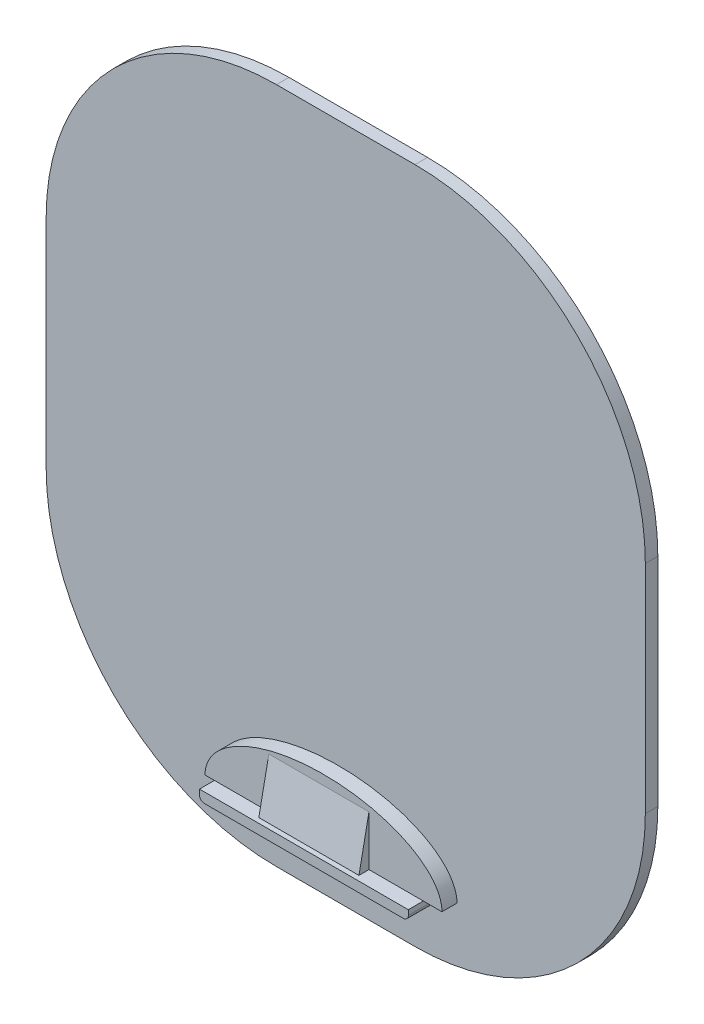
ISO-10303-21;
HEADER;
FILE_DESCRIPTION(('STEP AP214'),'2;1');
FILE_NAME('part.step','',(''),(''),'','','');
FILE_SCHEMA(('AUTOMOTIVE_DESIGN { 1 0 10303 214 1 1 1 1 }'));
ENDSEC;
DATA;
#1=APPLICATION_CONTEXT('core data for automotive mechanical design processes');
#2=APPLICATION_PROTOCOL_DEFINITION('international standard','automotive_design',2000,#1);
#3=PRODUCT_CONTEXT('',#1,'mechanical');
#4=PRODUCT('Part','Part','',(#3));
#5=PRODUCT_RELATED_PRODUCT_CATEGORY('part','',(#4));
#6=PRODUCT_DEFINITION_FORMATION('','',#4);
#7=PRODUCT_DEFINITION_CONTEXT('part definition',#1,'design');
#8=PRODUCT_DEFINITION('design','',#6,#7);
#9=PRODUCT_DEFINITION_SHAPE('','',#8);
#10=(LENGTH_UNIT() NAMED_UNIT(*) SI_UNIT(.MILLI.,.METRE.));
#11=(NAMED_UNIT(*) PLANE_ANGLE_UNIT() SI_UNIT($,.RADIAN.));
#12=(NAMED_UNIT(*) SI_UNIT($,.STERADIAN.) SOLID_ANGLE_UNIT());
#13=UNCERTAINTY_MEASURE_WITH_UNIT(LENGTH_MEASURE(1.E-05),#10,'distance_accuracy_value','');
#14=(GEOMETRIC_REPRESENTATION_CONTEXT(3) GLOBAL_UNCERTAINTY_ASSIGNED_CONTEXT((#13)) GLOBAL_UNIT_ASSIGNED_CONTEXT((#10,
#11,#12)) REPRESENTATION_CONTEXT('',''));
#15=CARTESIAN_POINT('',(0.,0.,0.));
#16=DIRECTION('',(0.,0.,1.));
#17=DIRECTION('',(1.,0.,0.));
#18=AXIS2_PLACEMENT_3D('',#15,#16,#17);
#19=CARTESIAN_POINT('',(182.485046838815,-74.9591967155463,22.86));
#20=DIRECTION('',(0.,-0.196116135138184,-0.98058067569092));
#21=DIRECTION('',(0.,0.98058067569092,-0.196116135138184));
#22=AXIS2_PLACEMENT_3D('',#19,#20,#21);
#23=PLANE('',#22);
#24=DIRECTION('',(0.,-0.98058067569092,0.196116135138184));
#25=VECTOR('',#24,1.);
#26=CARTESIAN_POINT('',(131.685046838815,-74.9591967155463,22.86));
#27=LINE('',#26,#25);
#28=CARTESIAN_POINT('',(131.685046838815,-74.9591967155463,22.86));
#29=VERTEX_POINT('',#28);
#30=CARTESIAN_POINT('',(131.685046838815,-100.359196715546,27.94));
#31=VERTEX_POINT('',#30);
#32=EDGE_CURVE('E92',#29,#31,#27,.T.);
#33=ORIENTED_EDGE('',*,*,#32,.T.);
#34=DIRECTION('',(-1.,0.,0.));
#35=VECTOR('',#34,1.);
#36=CARTESIAN_POINT('',(182.485046838815,-100.359196715546,27.94));
#37=LINE('',#36,#35);
#38=CARTESIAN_POINT('',(182.485046838815,-100.359196715546,27.94));
#39=VERTEX_POINT('',#38);
#40=EDGE_CURVE('E12',#39,#31,#37,.T.);
#41=ORIENTED_EDGE('',*,*,#40,.F.);
#42=DIRECTION('',(0.,-0.98058067569092,0.196116135138184));
#43=VECTOR('',#42,1.);
#44=CARTESIAN_POINT('',(182.485046838815,-74.9591967155463,22.86));
#45=LINE('',#44,#43);
#46=CARTESIAN_POINT('',(182.485046838815,-74.9591967155463,22.86));
#47=VERTEX_POINT('',#46);
#48=EDGE_CURVE('E85',#47,#39,#45,.T.);
#49=ORIENTED_EDGE('',*,*,#48,.F.);
#50=DIRECTION('',(-1.,0.,0.));
#51=VECTOR('',#50,1.);
#52=CARTESIAN_POINT('',(182.485046838815,-74.9591967155463,22.86));
#53=LINE('',#52,#51);
#54=EDGE_CURVE('E93',#47,#29,#53,.T.);
#55=ORIENTED_EDGE('',*,*,#54,.T.);
#56=EDGE_LOOP('',(#33,#41,#49,#55));
#57=FACE_BOUND('',#56,.T.);
#58=ADVANCED_FACE('F45',(#57),#23,.F.);
#59=CARTESIAN_POINT('',(182.485046838815,-100.359196715546,22.86));
#60=DIRECTION('',(0.,1.,0.));
#61=DIRECTION('',(0.,0.,1.));
#62=AXIS2_PLACEMENT_3D('',#59,#60,#61);
#63=PLANE('',#62);
#64=DIRECTION('',(0.,0.,-1.));
#65=VECTOR('',#64,1.);
#66=CARTESIAN_POINT('',(131.685046838815,-100.359196715546,22.86));
#67=LINE('',#66,#65);
#68=CARTESIAN_POINT('',(131.685046838815,-100.359196715546,22.86));
#69=VERTEX_POINT('',#68);
#70=EDGE_CURVE('E73',#31,#69,#67,.T.);
#71=ORIENTED_EDGE('',*,*,#70,.T.);
#72=DIRECTION('',(-1.,0.,0.));
#73=VECTOR('',#72,1.);
#74=CARTESIAN_POINT('',(182.485046838815,-100.359196715546,22.86));
#75=LINE('',#74,#73);
#76=CARTESIAN_POINT('',(182.485046838815,-100.359196715546,22.86));
#77=VERTEX_POINT('',#76);
#78=EDGE_CURVE('E53',#77,#69,#75,.T.);
#79=ORIENTED_EDGE('',*,*,#78,.F.);
#80=DIRECTION('',(0.,0.,-1.));
#81=VECTOR('',#80,1.);
#82=CARTESIAN_POINT('',(182.485046838815,-100.359196715546,22.86));
#83=LINE('',#82,#81);
#84=EDGE_CURVE('E81',#39,#77,#83,.T.);
#85=ORIENTED_EDGE('',*,*,#84,.F.);
#86=ORIENTED_EDGE('',*,*,#40,.T.);
#87=EDGE_LOOP('',(#71,#79,#85,#86));
#88=FACE_BOUND('',#87,.T.);
#89=ADVANCED_FACE('F82',(#88),#63,.F.);
#90=CARTESIAN_POINT('',(182.485046838815,-100.359196715546,22.86));
#91=DIRECTION('',(0.,0.,1.));
#92=DIRECTION('',(1.,0.,0.));
#93=AXIS2_PLACEMENT_3D('',#90,#91,#92);
#94=PLANE('',#93);
#95=DIRECTION('',(0.,1.,0.));
#96=VECTOR('',#95,1.);
#97=CARTESIAN_POINT('',(131.685046838815,-100.359196715546,22.86));
#98=LINE('',#97,#96);
#99=EDGE_CURVE('E78',#69,#29,#98,.T.);
#100=ORIENTED_EDGE('',*,*,#99,.T.);
#101=ORIENTED_EDGE('',*,*,#54,.F.);
#102=DIRECTION('',(0.,1.,0.));
#103=VECTOR('',#102,1.);
#104=CARTESIAN_POINT('',(182.485046838815,-100.359196715546,22.86));
#105=LINE('',#104,#103);
#106=EDGE_CURVE('E61',#77,#47,#105,.T.);
#107=ORIENTED_EDGE('',*,*,#106,.F.);
#108=ORIENTED_EDGE('',*,*,#78,.T.);
#109=EDGE_LOOP('',(#100,#101,#107,#108));
#110=FACE_BOUND('',#109,.T.);
#111=ADVANCED_FACE('F100',(#110),#94,.F.);
#112=CARTESIAN_POINT('',(182.485046838815,0.,0.));
#113=DIRECTION('',(-1.,0.,0.));
#114=DIRECTION('',(0.,0.,1.));
#115=AXIS2_PLACEMENT_3D('',#112,#113,#114);
#116=PLANE('',#115);
#117=ORIENTED_EDGE('',*,*,#48,.T.);
#118=ORIENTED_EDGE('',*,*,#84,.T.);
#119=ORIENTED_EDGE('',*,*,#106,.T.);
#120=EDGE_LOOP('',(#117,#118,#119));
#121=FACE_BOUND('',#120,.T.);
#122=ADVANCED_FACE('F88',(#121),#116,.F.);
#123=CARTESIAN_POINT('',(131.685046838815,0.,0.));
#124=DIRECTION('',(-1.,0.,0.));
#125=DIRECTION('',(0.,0.,1.));
#126=AXIS2_PLACEMENT_3D('',#123,#124,#125);
#127=PLANE('',#126);
#128=ORIENTED_EDGE('',*,*,#32,.F.);
#129=ORIENTED_EDGE('',*,*,#99,.F.);
#130=ORIENTED_EDGE('',*,*,#70,.F.);
#131=EDGE_LOOP('',(#128,#129,#130));
#132=FACE_BOUND('',#131,.T.);
#133=ADVANCED_FACE('F101',(#132),#127,.T.);
#134=CLOSED_SHELL('',(#58,#89,#111,#122,#133));
#135=MANIFOLD_SOLID_BREP('B2',#134);
#136=CARTESIAN_POINT('',(99.3113098154075,-100.359196715546,22.86));
#137=DIRECTION('',(0.,1.,0.));
#138=DIRECTION('',(0.,0.,1.));
#139=AXIS2_PLACEMENT_3D('',#136,#137,#138);
#140=PLANE('',#139);
#141=DIRECTION('',(0.,0.,-1.));
#142=VECTOR('',#141,1.);
#143=CARTESIAN_POINT('',(104.100842418384,-100.359196715546,30.48));
#144=LINE('',#143,#142);
#145=CARTESIAN_POINT('',(104.100842418384,-100.359196715546,22.86));
#146=VERTEX_POINT('',#145);
#147=CARTESIAN_POINT('',(104.100842418384,-100.359196715546,15.24));
#148=VERTEX_POINT('',#147);
#149=EDGE_CURVE('E312',#146,#148,#144,.T.);
#150=ORIENTED_EDGE('',*,*,#149,.F.);
#151=DIRECTION('',(1.,0.,0.));
#152=VECTOR('',#151,1.);
#153=CARTESIAN_POINT('',(99.3113098154075,-100.359196715546,22.86));
#154=LINE('',#153,#152);
#155=CARTESIAN_POINT('',(99.3113098154075,-100.359196715546,22.86));
#156=VERTEX_POINT('',#155);
#157=EDGE_CURVE('E327',#156,#146,#154,.T.);
#158=ORIENTED_EDGE('',*,*,#157,.F.);
#159=DIRECTION('',(0.,0.,-1.));
#160=VECTOR('',#159,1.);
#161=CARTESIAN_POINT('',(99.3113098154075,-100.359196715546,22.86));
#162=LINE('',#161,#160);
#163=CARTESIAN_POINT('',(99.3113098154075,-100.359196715546,15.24));
#164=VERTEX_POINT('',#163);
#165=EDGE_CURVE('E395',#156,#164,#162,.T.);
#166=ORIENTED_EDGE('',*,*,#165,.T.);
#167=DIRECTION('',(1.,0.,0.));
#168=VECTOR('',#167,1.);
#169=CARTESIAN_POINT('',(99.3113098154075,-100.359196715546,15.24));
#170=LINE('',#169,#168);
#171=EDGE_CURVE('E326',#164,#148,#170,.T.);
#172=ORIENTED_EDGE('',*,*,#171,.T.);
#173=EDGE_LOOP('',(#150,#158,#166,#172));
#174=FACE_BOUND('',#173,.T.);
#175=ADVANCED_FACE('F144',(#174),#140,.F.);
#176=CARTESIAN_POINT('',(198.236322143517,96.6293304832838,15.24));
#177=DIRECTION('',(0.,0.,1.));
#178=DIRECTION('',(1.,0.,0.));
#179=AXIS2_PLACEMENT_3D('',#176,#177,#178);
#180=PLANE('',#179);
#181=DIRECTION('',(0.,-1.,0.));
#182=VECTOR('',#181,1.);
#183=CARTESIAN_POINT('',(210.069251259246,0.,15.24));
#184=LINE('',#183,#182);
#185=CARTESIAN_POINT('',(210.069251259246,-100.359196715546,15.24));
#186=VERTEX_POINT('',#185);
#187=CARTESIAN_POINT('',(210.069251259246,-102.899196715546,15.24));
#188=VERTEX_POINT('',#187);
#189=EDGE_CURVE('E292',#186,#188,#184,.T.);
#190=ORIENTED_EDGE('',*,*,#189,.T.);
#191=CARTESIAN_POINT('',(207.529251259246,-102.899196715546,15.24));
#192=DIRECTION('',(0.,0.,1.));
#193=DIRECTION('',(1.,0.,0.));
#194=AXIS2_PLACEMENT_3D('',#191,#192,#193);
#195=CIRCLE('',#194,2.53999999999999);
#196=CARTESIAN_POINT('',(207.529251259246,-105.439196715546,15.24));
#197=VERTEX_POINT('',#196);
#198=EDGE_CURVE('E306',#197,#188,#195,.T.);
#199=ORIENTED_EDGE('',*,*,#198,.F.);
#200=DIRECTION('',(1.,0.,0.));
#201=VECTOR('',#200,1.);
#202=CARTESIAN_POINT('',(0.,-105.439196715546,15.24));
#203=LINE('',#202,#201);
#204=CARTESIAN_POINT('',(106.640842418384,-105.439196715546,15.24));
#205=VERTEX_POINT('',#204);
#206=EDGE_CURVE('E304',#205,#197,#203,.T.);
#207=ORIENTED_EDGE('',*,*,#206,.F.);
#208=CARTESIAN_POINT('',(106.640842418384,-102.899196715546,15.24));
#209=DIRECTION('',(0.,0.,1.));
#210=DIRECTION('',(1.,0.,0.));
#211=AXIS2_PLACEMENT_3D('',#208,#209,#210);
#212=CIRCLE('',#211,2.54);
#213=CARTESIAN_POINT('',(104.100842418384,-102.899196715546,15.24));
#214=VERTEX_POINT('',#213);
#215=EDGE_CURVE('E271',#205,#214,#212,.F.);
#216=ORIENTED_EDGE('',*,*,#215,.T.);
#217=DIRECTION('',(0.,-1.,0.));
#218=VECTOR('',#217,1.);
#219=CARTESIAN_POINT('',(104.100842418384,0.,15.24));
#220=LINE('',#219,#218);
#221=EDGE_CURVE('E289',#148,#214,#220,.T.);
#222=ORIENTED_EDGE('',*,*,#221,.F.);
#223=ORIENTED_EDGE('',*,*,#171,.F.);
#224=CARTESIAN_POINT('',(159.416414391619,-100.359196715546,15.24));
#225=DIRECTION('',(0.,0.,1.));
#226=DIRECTION('',(-1.,0.,0.));
#227=AXIS2_PLACEMENT_3D('',#224,#225,#226);
#228=ELLIPSE('',#227,60.1051045762115,30.3645512853403);
#229=CARTESIAN_POINT('',(219.52151896783,-100.359196715546,15.24));
#230=VERTEX_POINT('',#229);
#231=EDGE_CURVE('E167',#230,#164,#228,.T.);
#232=ORIENTED_EDGE('',*,*,#231,.F.);
#233=EDGE_CURVE('E476',#186,#230,#170,.T.);
#234=ORIENTED_EDGE('',*,*,#233,.F.);
#235=EDGE_LOOP('',(#190,#199,#207,#216,#222,#223,#232,#234));
#236=FACE_BOUND('',#235,.T.);
#237=CARTESIAN_POINT('',(198.236322143517,96.6293304832838,15.24));
#238=DIRECTION('',(0.,0.,1.));
#239=DIRECTION('',(1.,0.,0.));
#240=AXIS2_PLACEMENT_3D('',#237,#238,#239);
#241=CIRCLE('',#240,116.84);
#242=CARTESIAN_POINT('',(315.076322143517,96.6293304832829,15.24));
#243=VERTEX_POINT('',#242);
#244=CARTESIAN_POINT('',(198.236322143516,213.469330483284,15.24));
#245=VERTEX_POINT('',#244);
#246=EDGE_CURVE('E401',#243,#245,#241,.T.);
#247=ORIENTED_EDGE('',*,*,#246,.T.);
#248=DIRECTION('',(-1.,0.,0.));
#249=VECTOR('',#248,1.);
#250=CARTESIAN_POINT('',(198.236322143516,213.469330483284,15.24));
#251=LINE('',#250,#249);
#252=CARTESIAN_POINT('',(127.925881087908,213.469330483284,15.24));
#253=VERTEX_POINT('',#252);
#254=EDGE_CURVE('E404',#245,#253,#251,.T.);
#255=ORIENTED_EDGE('',*,*,#254,.T.);
#256=CARTESIAN_POINT('',(127.925881087907,96.6293304832838,15.24));
#257=DIRECTION('',(0.,0.,1.));
#258=DIRECTION('',(1.,0.,0.));
#259=AXIS2_PLACEMENT_3D('',#256,#257,#258);
#260=CIRCLE('',#259,116.84);
#261=CARTESIAN_POINT('',(11.0858810879068,96.6293304832829,15.24));
#262=VERTEX_POINT('',#261);
#263=EDGE_CURVE('E407',#253,#262,#260,.T.);
#264=ORIENTED_EDGE('',*,*,#263,.T.);
#265=DIRECTION('',(0.,-1.,0.));
#266=VECTOR('',#265,1.);
#267=CARTESIAN_POINT('',(11.0858810879068,-13.2856924943543,15.24));
#268=LINE('',#267,#266);
#269=CARTESIAN_POINT('',(11.0858810879068,-13.2856924943552,15.24));
#270=VERTEX_POINT('',#269);
#271=EDGE_CURVE('E409',#262,#270,#268,.T.);
#272=ORIENTED_EDGE('',*,*,#271,.T.);
#273=CARTESIAN_POINT('',(127.925881087907,-13.2856924943552,15.24));
#274=DIRECTION('',(0.,0.,1.));
#275=DIRECTION('',(-1.,0.,0.));
#276=AXIS2_PLACEMENT_3D('',#273,#274,#275);
#277=CIRCLE('',#276,116.84);
#278=CARTESIAN_POINT('',(127.925881087908,-130.125692494355,15.24));
#279=VERTEX_POINT('',#278);
#280=EDGE_CURVE('E411',#270,#279,#277,.T.);
#281=ORIENTED_EDGE('',*,*,#280,.T.);
#282=DIRECTION('',(1.,0.,0.));
#283=VECTOR('',#282,1.);
#284=CARTESIAN_POINT('',(198.236322143516,-130.125692494355,15.24));
#285=LINE('',#284,#283);
#286=CARTESIAN_POINT('',(198.236322143516,-130.125692494355,15.24));
#287=VERTEX_POINT('',#286);
#288=EDGE_CURVE('E413',#279,#287,#285,.T.);
#289=ORIENTED_EDGE('',*,*,#288,.T.);
#290=CARTESIAN_POINT('',(198.236322143517,-13.2856924943552,15.24));
#291=DIRECTION('',(0.,0.,1.));
#292=DIRECTION('',(-1.,0.,0.));
#293=AXIS2_PLACEMENT_3D('',#290,#291,#292);
#294=CIRCLE('',#293,116.84);
#295=CARTESIAN_POINT('',(315.076322143517,-13.2856924943544,15.24));
#296=VERTEX_POINT('',#295);
#297=EDGE_CURVE('E415',#287,#296,#294,.T.);
#298=ORIENTED_EDGE('',*,*,#297,.T.);
#299=DIRECTION('',(0.,1.,0.));
#300=VECTOR('',#299,1.);
#301=CARTESIAN_POINT('',(315.076322143517,96.6293304832829,15.24));
#302=LINE('',#301,#300);
#303=EDGE_CURVE('E417',#296,#243,#302,.T.);
#304=ORIENTED_EDGE('',*,*,#303,.T.);
#305=EDGE_LOOP('',(#247,#255,#264,#272,#281,#289,#298,#304));
#306=FACE_BOUND('',#305,.T.);
#307=ADVANCED_FACE('F337',(#236,#306),#180,.T.);
#308=CARTESIAN_POINT('',(198.236322143517,96.6293304832838,15.24));
#309=DIRECTION('',(0.,0.,-1.));
#310=DIRECTION('',(-1.,0.,0.));
#311=AXIS2_PLACEMENT_3D('',#308,#309,#310);
#312=CYLINDRICAL_SURFACE('',#311,116.84);
#313=CARTESIAN_POINT('',(198.236322143517,96.6293304832838,8.89));
#314=DIRECTION('',(0.,0.,1.));
#315=DIRECTION('',(1.,0.,0.));
#316=AXIS2_PLACEMENT_3D('',#313,#314,#315);
#317=CIRCLE('',#316,116.84);
#318=CARTESIAN_POINT('',(315.076322143517,96.6293304832829,8.89));
#319=VERTEX_POINT('',#318);
#320=CARTESIAN_POINT('',(198.236322143516,213.469330483284,8.89));
#321=VERTEX_POINT('',#320);
#322=EDGE_CURVE('E397',#319,#321,#317,.T.);
#323=ORIENTED_EDGE('',*,*,#322,.T.);
#324=DIRECTION('',(0.,0.,-1.));
#325=VECTOR('',#324,1.);
#326=CARTESIAN_POINT('',(198.236322143516,213.469330483284,15.24));
#327=LINE('',#326,#325);
#328=EDGE_CURVE('E43',#245,#321,#327,.T.);
#329=ORIENTED_EDGE('',*,*,#328,.F.);
#330=ORIENTED_EDGE('',*,*,#246,.F.);
#331=DIRECTION('',(0.,0.,-1.));
#332=VECTOR('',#331,1.);
#333=CARTESIAN_POINT('',(315.076322143517,96.6293304832829,15.24));
#334=LINE('',#333,#332);
#335=EDGE_CURVE('E419',#243,#319,#334,.T.);
#336=ORIENTED_EDGE('',*,*,#335,.T.);
#337=EDGE_LOOP('',(#323,#329,#330,#336));
#338=FACE_BOUND('',#337,.T.);
#339=ADVANCED_FACE('F146',(#338),#312,.T.);
#340=CARTESIAN_POINT('',(198.236322143516,213.469330483284,15.24));
#341=DIRECTION('',(0.,-1.,0.));
#342=DIRECTION('',(1.,0.,0.));
#343=AXIS2_PLACEMENT_3D('',#340,#341,#342);
#344=PLANE('',#343);
#345=DIRECTION('',(-1.,0.,0.));
#346=VECTOR('',#345,1.);
#347=CARTESIAN_POINT('',(198.236322143516,213.469330483284,8.89));
#348=LINE('',#347,#346);
#349=CARTESIAN_POINT('',(127.925881087908,213.469330483284,8.89));
#350=VERTEX_POINT('',#349);
#351=EDGE_CURVE('E422',#321,#350,#348,.T.);
#352=ORIENTED_EDGE('',*,*,#351,.T.);
#353=DIRECTION('',(0.,0.,-1.));
#354=VECTOR('',#353,1.);
#355=CARTESIAN_POINT('',(127.925881087908,213.469330483284,15.24));
#356=LINE('',#355,#354);
#357=EDGE_CURVE('E152',#253,#350,#356,.T.);
#358=ORIENTED_EDGE('',*,*,#357,.F.);
#359=ORIENTED_EDGE('',*,*,#254,.F.);
#360=ORIENTED_EDGE('',*,*,#328,.T.);
#361=EDGE_LOOP('',(#352,#358,#359,#360));
#362=FACE_BOUND('',#361,.T.);
#363=ADVANCED_FACE('F366',(#362),#344,.F.);
#364=CARTESIAN_POINT('',(127.925881087907,96.6293304832838,15.24));
#365=DIRECTION('',(0.,0.,-1.));
#366=DIRECTION('',(-1.,0.,0.));
#367=AXIS2_PLACEMENT_3D('',#364,#365,#366);
#368=CYLINDRICAL_SURFACE('',#367,116.84);
#369=CARTESIAN_POINT('',(127.925881087907,96.6293304832838,8.89));
#370=DIRECTION('',(0.,0.,1.));
#371=DIRECTION('',(1.,0.,0.));
#372=AXIS2_PLACEMENT_3D('',#369,#370,#371);
#373=CIRCLE('',#372,116.84);
#374=CARTESIAN_POINT('',(11.0858810879068,96.6293304832829,8.89));
#375=VERTEX_POINT('',#374);
#376=EDGE_CURVE('E424',#350,#375,#373,.T.);
#377=ORIENTED_EDGE('',*,*,#376,.T.);
#378=DIRECTION('',(0.,0.,-1.));
#379=VECTOR('',#378,1.);
#380=CARTESIAN_POINT('',(11.0858810879068,96.6293304832829,15.24));
#381=LINE('',#380,#379);
#382=EDGE_CURVE('E449',#262,#375,#381,.T.);
#383=ORIENTED_EDGE('',*,*,#382,.F.);
#384=ORIENTED_EDGE('',*,*,#263,.F.);
#385=ORIENTED_EDGE('',*,*,#357,.T.);
#386=EDGE_LOOP('',(#377,#383,#384,#385));
#387=FACE_BOUND('',#386,.T.);
#388=ADVANCED_FACE('F363',(#387),#368,.T.);
#389=CARTESIAN_POINT('',(11.0858810879068,-13.2856924943543,15.24));
#390=DIRECTION('',(1.,0.,0.));
#391=DIRECTION('',(0.,1.,0.));
#392=AXIS2_PLACEMENT_3D('',#389,#390,#391);
#393=PLANE('',#392);
#394=DIRECTION('',(0.,-1.,0.));
#395=VECTOR('',#394,1.);
#396=CARTESIAN_POINT('',(11.0858810879068,-13.2856924943543,8.89));
#397=LINE('',#396,#395);
#398=CARTESIAN_POINT('',(11.0858810879068,-13.2856924943552,8.89));
#399=VERTEX_POINT('',#398);
#400=EDGE_CURVE('E426',#375,#399,#397,.T.);
#401=ORIENTED_EDGE('',*,*,#400,.T.);
#402=DIRECTION('',(0.,0.,-1.));
#403=VECTOR('',#402,1.);
#404=CARTESIAN_POINT('',(11.0858810879068,-13.2856924943552,15.24));
#405=LINE('',#404,#403);
#406=EDGE_CURVE('E446',#270,#399,#405,.T.);
#407=ORIENTED_EDGE('',*,*,#406,.F.);
#408=ORIENTED_EDGE('',*,*,#271,.F.);
#409=ORIENTED_EDGE('',*,*,#382,.T.);
#410=EDGE_LOOP('',(#401,#407,#408,#409));
#411=FACE_BOUND('',#410,.T.);
#412=ADVANCED_FACE('F359',(#411),#393,.F.);
#413=CARTESIAN_POINT('',(127.925881087907,-13.2856924943552,15.24));
#414=DIRECTION('',(0.,0.,-1.));
#415=DIRECTION('',(-1.,0.,0.));
#416=AXIS2_PLACEMENT_3D('',#413,#414,#415);
#417=CYLINDRICAL_SURFACE('',#416,116.84);
#418=CARTESIAN_POINT('',(127.925881087907,-13.2856924943552,8.89));
#419=DIRECTION('',(0.,0.,1.));
#420=DIRECTION('',(-1.,0.,0.));
#421=AXIS2_PLACEMENT_3D('',#418,#419,#420);
#422=CIRCLE('',#421,116.84);
#423=CARTESIAN_POINT('',(127.925881087908,-130.125692494355,8.89));
#424=VERTEX_POINT('',#423);
#425=EDGE_CURVE('E428',#399,#424,#422,.T.);
#426=ORIENTED_EDGE('',*,*,#425,.T.);
#427=DIRECTION('',(0.,0.,-1.));
#428=VECTOR('',#427,1.);
#429=CARTESIAN_POINT('',(127.925881087908,-130.125692494355,15.24));
#430=LINE('',#429,#428);
#431=EDGE_CURVE('E443',#279,#424,#430,.T.);
#432=ORIENTED_EDGE('',*,*,#431,.F.);
#433=ORIENTED_EDGE('',*,*,#280,.F.);
#434=ORIENTED_EDGE('',*,*,#406,.T.);
#435=EDGE_LOOP('',(#426,#432,#433,#434));
#436=FACE_BOUND('',#435,.T.);
#437=ADVANCED_FACE('F355',(#436),#417,.T.);
#438=CARTESIAN_POINT('',(198.236322143516,-130.125692494355,15.24));
#439=DIRECTION('',(0.,1.,0.));
#440=DIRECTION('',(0.,0.,1.));
#441=AXIS2_PLACEMENT_3D('',#438,#439,#440);
#442=PLANE('',#441);
#443=DIRECTION('',(1.,0.,0.));
#444=VECTOR('',#443,1.);
#445=CARTESIAN_POINT('',(198.236322143516,-130.125692494355,8.89));
#446=LINE('',#445,#444);
#447=CARTESIAN_POINT('',(198.236322143516,-130.125692494355,8.89));
#448=VERTEX_POINT('',#447);
#449=EDGE_CURVE('E430',#424,#448,#446,.T.);
#450=ORIENTED_EDGE('',*,*,#449,.T.);
#451=DIRECTION('',(0.,0.,-1.));
#452=VECTOR('',#451,1.);
#453=CARTESIAN_POINT('',(198.236322143516,-130.125692494355,15.24));
#454=LINE('',#453,#452);
#455=EDGE_CURVE('E440',#287,#448,#454,.T.);
#456=ORIENTED_EDGE('',*,*,#455,.F.);
#457=ORIENTED_EDGE('',*,*,#288,.F.);
#458=ORIENTED_EDGE('',*,*,#431,.T.);
#459=EDGE_LOOP('',(#450,#456,#457,#458));
#460=FACE_BOUND('',#459,.T.);
#461=ADVANCED_FACE('F351',(#460),#442,.F.);
#462=CARTESIAN_POINT('',(198.236322143517,-13.2856924943552,15.24));
#463=DIRECTION('',(0.,0.,-1.));
#464=DIRECTION('',(-1.,0.,0.));
#465=AXIS2_PLACEMENT_3D('',#462,#463,#464);
#466=CYLINDRICAL_SURFACE('',#465,116.84);
#467=CARTESIAN_POINT('',(198.236322143517,-13.2856924943552,8.89));
#468=DIRECTION('',(0.,0.,1.));
#469=DIRECTION('',(-1.,0.,0.));
#470=AXIS2_PLACEMENT_3D('',#467,#468,#469);
#471=CIRCLE('',#470,116.84);
#472=CARTESIAN_POINT('',(315.076322143517,-13.2856924943544,8.89));
#473=VERTEX_POINT('',#472);
#474=EDGE_CURVE('E432',#448,#473,#471,.T.);
#475=ORIENTED_EDGE('',*,*,#474,.T.);
#476=DIRECTION('',(0.,0.,-1.));
#477=VECTOR('',#476,1.);
#478=CARTESIAN_POINT('',(315.076322143517,-13.2856924943544,15.24));
#479=LINE('',#478,#477);
#480=EDGE_CURVE('E437',#296,#473,#479,.T.);
#481=ORIENTED_EDGE('',*,*,#480,.F.);
#482=ORIENTED_EDGE('',*,*,#297,.F.);
#483=ORIENTED_EDGE('',*,*,#455,.T.);
#484=EDGE_LOOP('',(#475,#481,#482,#483));
#485=FACE_BOUND('',#484,.T.);
#486=ADVANCED_FACE('F347',(#485),#466,.T.);
#487=CARTESIAN_POINT('',(315.076322143517,96.6293304832829,15.24));
#488=DIRECTION('',(-1.,0.,0.));
#489=DIRECTION('',(0.,0.,1.));
#490=AXIS2_PLACEMENT_3D('',#487,#488,#489);
#491=PLANE('',#490);
#492=DIRECTION('',(0.,1.,0.));
#493=VECTOR('',#492,1.);
#494=CARTESIAN_POINT('',(315.076322143517,96.6293304832829,8.89));
#495=LINE('',#494,#493);
#496=EDGE_CURVE('E405',#473,#319,#495,.T.);
#497=ORIENTED_EDGE('',*,*,#496,.T.);
#498=ORIENTED_EDGE('',*,*,#335,.F.);
#499=ORIENTED_EDGE('',*,*,#303,.F.);
#500=ORIENTED_EDGE('',*,*,#480,.T.);
#501=EDGE_LOOP('',(#497,#498,#499,#500));
#502=FACE_BOUND('',#501,.T.);
#503=ADVANCED_FACE('F343',(#502),#491,.F.);
#504=CARTESIAN_POINT('',(198.236322143517,96.6293304832838,8.89));
#505=DIRECTION('',(0.,0.,1.));
#506=DIRECTION('',(1.,0.,0.));
#507=AXIS2_PLACEMENT_3D('',#504,#505,#506);
#508=PLANE('',#507);
#509=ORIENTED_EDGE('',*,*,#322,.F.);
#510=ORIENTED_EDGE('',*,*,#496,.F.);
#511=ORIENTED_EDGE('',*,*,#474,.F.);
#512=ORIENTED_EDGE('',*,*,#449,.F.);
#513=ORIENTED_EDGE('',*,*,#425,.F.);
#514=ORIENTED_EDGE('',*,*,#400,.F.);
#515=ORIENTED_EDGE('',*,*,#376,.F.);
#516=ORIENTED_EDGE('',*,*,#351,.F.);
#517=EDGE_LOOP('',(#509,#510,#511,#512,#513,#514,#515,#516));
#518=FACE_BOUND('',#517,.T.);
#519=ADVANCED_FACE('F335',(#518),#508,.F.);
#520=CARTESIAN_POINT('',(159.416414391619,-100.359196715546,22.86));
#521=DIRECTION('',(0.,0.,1.));
#522=DIRECTION('',(-1.,0.,0.));
#523=AXIS2_PLACEMENT_3D('',#520,#521,#522);
#524=ELLIPSE('',#523,60.1051045762115,30.3645512853403);
#525=DIRECTION('',(0.,0.,-1.));
#526=VECTOR('',#525,1.);
#527=SURFACE_OF_LINEAR_EXTRUSION('',#524,#526);
#528=ORIENTED_EDGE('',*,*,#231,.T.);
#529=ORIENTED_EDGE('',*,*,#165,.F.);
#530=CARTESIAN_POINT('',(219.52151896783,-100.359196715546,22.86));
#531=VERTEX_POINT('',#530);
#532=EDGE_CURVE('E321',#531,#156,#524,.T.);
#533=ORIENTED_EDGE('',*,*,#532,.F.);
#534=DIRECTION('',(0.,0.,-1.));
#535=VECTOR('',#534,1.);
#536=CARTESIAN_POINT('',(219.52151896783,-100.359196715546,22.86));
#537=LINE('',#536,#535);
#538=EDGE_CURVE('E391',#531,#230,#537,.T.);
#539=ORIENTED_EDGE('',*,*,#538,.T.);
#540=EDGE_LOOP('',(#528,#529,#533,#539));
#541=FACE_BOUND('',#540,.T.);
#542=ADVANCED_FACE('F330',(#541),#527,.F.);
#543=CARTESIAN_POINT('',(210.069251259246,-100.359196715546,22.86));
#544=VERTEX_POINT('',#543);
#545=EDGE_CURVE('E325',#544,#531,#154,.T.);
#546=ORIENTED_EDGE('',*,*,#545,.F.);
#547=DIRECTION('',(0.,0.,-1.));
#548=VECTOR('',#547,1.);
#549=CARTESIAN_POINT('',(210.069251259246,-100.359196715546,30.48));
#550=LINE('',#549,#548);
#551=EDGE_CURVE('E316',#544,#186,#550,.T.);
#552=ORIENTED_EDGE('',*,*,#551,.T.);
#553=ORIENTED_EDGE('',*,*,#233,.T.);
#554=ORIENTED_EDGE('',*,*,#538,.F.);
#555=EDGE_LOOP('',(#546,#552,#553,#554));
#556=FACE_BOUND('',#555,.T.);
#557=ADVANCED_FACE('F334',(#556),#140,.F.);
#558=CARTESIAN_POINT('',(159.416414391619,-100.359196715546,22.86));
#559=DIRECTION('',(0.,0.,1.));
#560=DIRECTION('',(1.,0.,0.));
#561=AXIS2_PLACEMENT_3D('',#558,#559,#560);
#562=PLANE('',#561);
#563=ORIENTED_EDGE('',*,*,#532,.T.);
#564=ORIENTED_EDGE('',*,*,#157,.T.);
#565=EDGE_CURVE('E393',#146,#544,#154,.T.);
#566=ORIENTED_EDGE('',*,*,#565,.T.);
#567=ORIENTED_EDGE('',*,*,#545,.T.);
#568=EDGE_LOOP('',(#563,#564,#566,#567));
#569=FACE_BOUND('',#568,.T.);
#570=ADVANCED_FACE('F380',(#569),#562,.T.);
#571=CARTESIAN_POINT('',(106.640842418384,-102.899196715546,30.48));
#572=DIRECTION('',(0.,0.,-1.));
#573=DIRECTION('',(-1.,0.,0.));
#574=AXIS2_PLACEMENT_3D('',#571,#572,#573);
#575=CYLINDRICAL_SURFACE('',#574,2.54);
#576=ORIENTED_EDGE('',*,*,#215,.F.);
#577=DIRECTION('',(0.,0.,-1.));
#578=VECTOR('',#577,1.);
#579=CARTESIAN_POINT('',(106.640842418384,-105.439196715546,30.48));
#580=LINE('',#579,#578);
#581=CARTESIAN_POINT('',(106.640842418384,-105.439196715546,30.48));
#582=VERTEX_POINT('',#581);
#583=EDGE_CURVE('E265',#582,#205,#580,.T.);
#584=ORIENTED_EDGE('',*,*,#583,.F.);
#585=CARTESIAN_POINT('',(106.640842418384,-102.899196715546,30.48));
#586=DIRECTION('',(0.,0.,1.));
#587=DIRECTION('',(1.,0.,0.));
#588=AXIS2_PLACEMENT_3D('',#585,#586,#587);
#589=CIRCLE('',#588,2.54);
#590=CARTESIAN_POINT('',(104.100842418384,-102.899196715546,30.48));
#591=VERTEX_POINT('',#590);
#592=EDGE_CURVE('E269',#582,#591,#589,.F.);
#593=ORIENTED_EDGE('',*,*,#592,.T.);
#594=DIRECTION('',(0.,0.,-1.));
#595=VECTOR('',#594,1.);
#596=CARTESIAN_POINT('',(104.100842418384,-102.899196715546,30.48));
#597=LINE('',#596,#595);
#598=EDGE_CURVE('E302',#591,#214,#597,.T.);
#599=ORIENTED_EDGE('',*,*,#598,.T.);
#600=EDGE_LOOP('',(#576,#584,#593,#599));
#601=FACE_BOUND('',#600,.T.);
#602=ADVANCED_FACE('F267',(#601),#575,.T.);
#603=CARTESIAN_POINT('',(0.,-105.439196715546,30.48));
#604=DIRECTION('',(0.,1.,0.));
#605=DIRECTION('',(0.,0.,1.));
#606=AXIS2_PLACEMENT_3D('',#603,#604,#605);
#607=PLANE('',#606);
#608=ORIENTED_EDGE('',*,*,#206,.T.);
#609=DIRECTION('',(0.,0.,-1.));
#610=VECTOR('',#609,1.);
#611=CARTESIAN_POINT('',(207.529251259246,-105.439196715546,30.48));
#612=LINE('',#611,#610);
#613=CARTESIAN_POINT('',(207.529251259246,-105.439196715546,30.48));
#614=VERTEX_POINT('',#613);
#615=EDGE_CURVE('E274',#614,#197,#612,.T.);
#616=ORIENTED_EDGE('',*,*,#615,.F.);
#617=DIRECTION('',(1.,0.,0.));
#618=VECTOR('',#617,1.);
#619=CARTESIAN_POINT('',(0.,-105.439196715546,30.48));
#620=LINE('',#619,#618);
#621=EDGE_CURVE('E277',#582,#614,#620,.T.);
#622=ORIENTED_EDGE('',*,*,#621,.F.);
#623=ORIENTED_EDGE('',*,*,#583,.T.);
#624=EDGE_LOOP('',(#608,#616,#622,#623));
#625=FACE_BOUND('',#624,.T.);
#626=ADVANCED_FACE('F278',(#625),#607,.F.);
#627=CARTESIAN_POINT('',(207.529251259246,-102.899196715546,30.48));
#628=DIRECTION('',(0.,0.,-1.));
#629=DIRECTION('',(-1.,0.,0.));
#630=AXIS2_PLACEMENT_3D('',#627,#628,#629);
#631=CYLINDRICAL_SURFACE('',#630,2.53999999999999);
#632=ORIENTED_EDGE('',*,*,#198,.T.);
#633=DIRECTION('',(0.,0.,-1.));
#634=VECTOR('',#633,1.);
#635=CARTESIAN_POINT('',(210.069251259246,-102.899196715546,30.48));
#636=LINE('',#635,#634);
#637=CARTESIAN_POINT('',(210.069251259246,-102.899196715546,30.48));
#638=VERTEX_POINT('',#637);
#639=EDGE_CURVE('E318',#638,#188,#636,.T.);
#640=ORIENTED_EDGE('',*,*,#639,.F.);
#641=CARTESIAN_POINT('',(207.529251259246,-102.899196715546,30.48));
#642=DIRECTION('',(0.,0.,1.));
#643=DIRECTION('',(1.,0.,0.));
#644=AXIS2_PLACEMENT_3D('',#641,#642,#643);
#645=CIRCLE('',#644,2.53999999999999);
#646=EDGE_CURVE('E282',#614,#638,#645,.T.);
#647=ORIENTED_EDGE('',*,*,#646,.F.);
#648=ORIENTED_EDGE('',*,*,#615,.T.);
#649=EDGE_LOOP('',(#632,#640,#647,#648));
#650=FACE_BOUND('',#649,.T.);
#651=ADVANCED_FACE('F488',(#650),#631,.T.);
#652=CARTESIAN_POINT('',(210.069251259246,0.,30.48));
#653=DIRECTION('',(1.,0.,0.));
#654=DIRECTION('',(0.,0.,-1.));
#655=AXIS2_PLACEMENT_3D('',#652,#653,#654);
#656=PLANE('',#655);
#657=ORIENTED_EDGE('',*,*,#189,.F.);
#658=ORIENTED_EDGE('',*,*,#551,.F.);
#659=CARTESIAN_POINT('',(210.069251259246,-100.359196715546,30.48));
#660=VERTEX_POINT('',#659);
#661=EDGE_CURVE('E159',#660,#544,#550,.T.);
#662=ORIENTED_EDGE('',*,*,#661,.F.);
#663=DIRECTION('',(0.,-1.,0.));
#664=VECTOR('',#663,1.);
#665=CARTESIAN_POINT('',(210.069251259246,0.,30.48));
#666=LINE('',#665,#664);
#667=EDGE_CURVE('E296',#660,#638,#666,.T.);
#668=ORIENTED_EDGE('',*,*,#667,.T.);
#669=ORIENTED_EDGE('',*,*,#639,.T.);
#670=EDGE_LOOP('',(#657,#658,#662,#668,#669));
#671=FACE_BOUND('',#670,.T.);
#672=ADVANCED_FACE('F486',(#671),#656,.T.);
#673=CARTESIAN_POINT('',(0.,-100.359196715546,30.48));
#674=DIRECTION('',(0.,1.,0.));
#675=DIRECTION('',(0.,0.,1.));
#676=AXIS2_PLACEMENT_3D('',#673,#674,#675);
#677=PLANE('',#676);
#678=ORIENTED_EDGE('',*,*,#661,.T.);
#679=ORIENTED_EDGE('',*,*,#565,.F.);
#680=CARTESIAN_POINT('',(104.100842418384,-100.359196715546,30.48));
#681=VERTEX_POINT('',#680);
#682=EDGE_CURVE('E313',#681,#146,#144,.T.);
#683=ORIENTED_EDGE('',*,*,#682,.F.);
#684=DIRECTION('',(1.,0.,0.));
#685=VECTOR('',#684,1.);
#686=CARTESIAN_POINT('',(0.,-100.359196715546,30.48));
#687=LINE('',#686,#685);
#688=EDGE_CURVE('E299',#681,#660,#687,.T.);
#689=ORIENTED_EDGE('',*,*,#688,.T.);
#690=EDGE_LOOP('',(#678,#679,#683,#689));
#691=FACE_BOUND('',#690,.T.);
#692=ADVANCED_FACE('F482',(#691),#677,.T.);
#693=CARTESIAN_POINT('',(104.100842418384,0.,30.48));
#694=DIRECTION('',(1.,0.,0.));
#695=DIRECTION('',(0.,0.,-1.));
#696=AXIS2_PLACEMENT_3D('',#693,#694,#695);
#697=PLANE('',#696);
#698=ORIENTED_EDGE('',*,*,#221,.T.);
#699=ORIENTED_EDGE('',*,*,#598,.F.);
#700=DIRECTION('',(0.,-1.,0.));
#701=VECTOR('',#700,1.);
#702=CARTESIAN_POINT('',(104.100842418384,0.,30.48));
#703=LINE('',#702,#701);
#704=EDGE_CURVE('E287',#681,#591,#703,.T.);
#705=ORIENTED_EDGE('',*,*,#704,.F.);
#706=ORIENTED_EDGE('',*,*,#682,.T.);
#707=ORIENTED_EDGE('',*,*,#149,.T.);
#708=EDGE_LOOP('',(#698,#699,#705,#706,#707));
#709=FACE_BOUND('',#708,.T.);
#710=ADVANCED_FACE('F481',(#709),#697,.F.);
#711=CARTESIAN_POINT('',(0.,0.,30.48));
#712=DIRECTION('',(0.,0.,1.));
#713=DIRECTION('',(1.,0.,0.));
#714=AXIS2_PLACEMENT_3D('',#711,#712,#713);
#715=PLANE('',#714);
#716=ORIENTED_EDGE('',*,*,#592,.F.);
#717=ORIENTED_EDGE('',*,*,#621,.T.);
#718=ORIENTED_EDGE('',*,*,#646,.T.);
#719=ORIENTED_EDGE('',*,*,#667,.F.);
#720=ORIENTED_EDGE('',*,*,#688,.F.);
#721=ORIENTED_EDGE('',*,*,#704,.T.);
#722=EDGE_LOOP('',(#716,#717,#718,#719,#720,#721));
#723=FACE_BOUND('',#722,.T.);
#724=ADVANCED_FACE('F284',(#723),#715,.T.);
#725=CLOSED_SHELL('',(#175,#307,#339,#363,#388,#412,#437,#461,#486,#503,#519,#542,#557,#570,
#602,#626,#651,#672,#692,#710,#724));
#726=MANIFOLD_SOLID_BREP('B6',#725);
#727=ADVANCED_BREP_SHAPE_REPRESENTATION('',(#18,#135,#726),#14);
#728=SHAPE_DEFINITION_REPRESENTATION(#9,#727);
ENDSEC;
END-ISO-10303-21;
